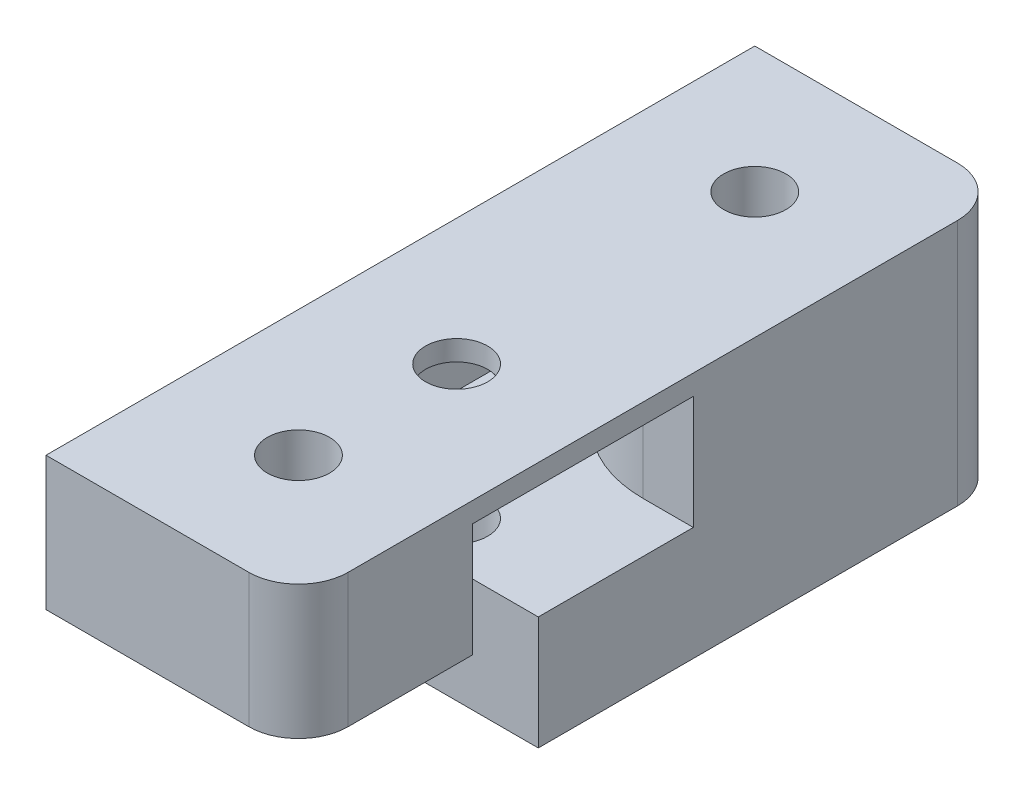
ISO-10303-21;
HEADER;
FILE_DESCRIPTION(('STEP AP214'),'2;1');
FILE_NAME('part.step','',(''),(''),'','','');
FILE_SCHEMA(('AUTOMOTIVE_DESIGN { 1 0 10303 214 1 1 1 1 }'));
ENDSEC;
DATA;
#1=APPLICATION_CONTEXT('core data for automotive mechanical design processes');
#2=APPLICATION_PROTOCOL_DEFINITION('international standard','automotive_design',2000,#1);
#3=PRODUCT_CONTEXT('',#1,'mechanical');
#4=PRODUCT('Part','Part','',(#3));
#5=PRODUCT_RELATED_PRODUCT_CATEGORY('part','',(#4));
#6=PRODUCT_DEFINITION_FORMATION('','',#4);
#7=PRODUCT_DEFINITION_CONTEXT('part definition',#1,'design');
#8=PRODUCT_DEFINITION('design','',#6,#7);
#9=PRODUCT_DEFINITION_SHAPE('','',#8);
#10=(LENGTH_UNIT() NAMED_UNIT(*) SI_UNIT(.MILLI.,.METRE.));
#11=(NAMED_UNIT(*) PLANE_ANGLE_UNIT() SI_UNIT($,.RADIAN.));
#12=(NAMED_UNIT(*) SI_UNIT($,.STERADIAN.) SOLID_ANGLE_UNIT());
#13=UNCERTAINTY_MEASURE_WITH_UNIT(LENGTH_MEASURE(1.E-05),#10,'distance_accuracy_value','');
#14=(GEOMETRIC_REPRESENTATION_CONTEXT(3) GLOBAL_UNCERTAINTY_ASSIGNED_CONTEXT((#13)) GLOBAL_UNIT_ASSIGNED_CONTEXT((#10,
#11,#12)) REPRESENTATION_CONTEXT('',''));
#15=CARTESIAN_POINT('',(0.,0.,0.));
#16=DIRECTION('',(0.,0.,1.));
#17=DIRECTION('',(1.,0.,0.));
#18=AXIS2_PLACEMENT_3D('',#15,#16,#17);
#19=CARTESIAN_POINT('',(-10.16,19.9,-46.89));
#20=DIRECTION('',(0.,0.,1.));
#21=DIRECTION('',(1.,0.,0.));
#22=AXIS2_PLACEMENT_3D('',#19,#20,#21);
#23=PLANE('',#22);
#24=DIRECTION('',(-1.,0.,0.));
#25=VECTOR('',#24,1.);
#26=CARTESIAN_POINT('',(-10.16,19.9,-46.89));
#27=LINE('',#26,#25);
#28=CARTESIAN_POINT('',(6.16,19.9,-46.89));
#29=VERTEX_POINT('',#28);
#30=CARTESIAN_POINT('',(-10.16,19.9,-46.89));
#31=VERTEX_POINT('',#30);
#32=EDGE_CURVE('E287',#29,#31,#27,.T.);
#33=ORIENTED_EDGE('',*,*,#32,.F.);
#34=DIRECTION('',(0.,-1.,0.));
#35=VECTOR('',#34,1.);
#36=CARTESIAN_POINT('',(6.16,19.9,-46.89));
#37=LINE('',#36,#35);
#38=CARTESIAN_POINT('',(6.16,0.,-46.89));
#39=VERTEX_POINT('',#38);
#40=EDGE_CURVE('E305',#29,#39,#37,.T.);
#41=ORIENTED_EDGE('',*,*,#40,.T.);
#42=DIRECTION('',(-1.,0.,0.));
#43=VECTOR('',#42,1.);
#44=CARTESIAN_POINT('',(-10.16,0.,-46.89));
#45=LINE('',#44,#43);
#46=CARTESIAN_POINT('',(-10.16,0.,-46.89));
#47=VERTEX_POINT('',#46);
#48=EDGE_CURVE('E297',#39,#47,#45,.T.);
#49=ORIENTED_EDGE('',*,*,#48,.T.);
#50=DIRECTION('',(0.,-1.,0.));
#51=VECTOR('',#50,1.);
#52=CARTESIAN_POINT('',(-10.16,19.9,-46.89));
#53=LINE('',#52,#51);
#54=EDGE_CURVE('E302',#31,#47,#53,.T.);
#55=ORIENTED_EDGE('',*,*,#54,.F.);
#56=EDGE_LOOP('',(#33,#41,#49,#55));
#57=FACE_BOUND('',#56,.T.);
#58=DIRECTION('',(1.,0.,0.));
#59=VECTOR('',#58,1.);
#60=CARTESIAN_POINT('',(-1.016,18.272,-46.89));
#61=LINE('',#60,#59);
#62=CARTESIAN_POINT('',(-8.89000000000001,18.272,-46.89));
#63=VERTEX_POINT('',#62);
#64=CARTESIAN_POINT('',(-3.89,18.272,-46.89));
#65=VERTEX_POINT('',#64);
#66=EDGE_CURVE('E188',#63,#65,#61,.T.);
#67=ORIENTED_EDGE('',*,*,#66,.F.);
#68=DIRECTION('',(0.,-1.,0.));
#69=VECTOR('',#68,1.);
#70=CARTESIAN_POINT('',(-8.89000000000001,18.272,-46.89));
#71=LINE('',#70,#69);
#72=CARTESIAN_POINT('',(-8.89000000000001,9.136,-46.89));
#73=VERTEX_POINT('',#72);
#74=EDGE_CURVE('E238',#63,#73,#71,.T.);
#75=ORIENTED_EDGE('',*,*,#74,.T.);
#76=DIRECTION('',(1.,0.,0.));
#77=VECTOR('',#76,1.);
#78=CARTESIAN_POINT('',(-1.016,9.136,-46.89));
#79=LINE('',#78,#77);
#80=CARTESIAN_POINT('',(-3.89,9.136,-46.89));
#81=VERTEX_POINT('',#80);
#82=EDGE_CURVE('E209',#73,#81,#79,.T.);
#83=ORIENTED_EDGE('',*,*,#82,.T.);
#84=DIRECTION('',(0.,-1.,0.));
#85=VECTOR('',#84,1.);
#86=CARTESIAN_POINT('',(-3.89,18.272,-46.89));
#87=LINE('',#86,#85);
#88=EDGE_CURVE('E182',#65,#81,#87,.T.);
#89=ORIENTED_EDGE('',*,*,#88,.F.);
#90=EDGE_LOOP('',(#67,#75,#83,#89));
#91=FACE_BOUND('',#90,.T.);
#92=ADVANCED_FACE('F34',(#57,#91),#23,.F.);
#93=CARTESIAN_POINT('',(0.,0.,-12.73));
#94=DIRECTION('',(0.,1.,0.));
#95=DIRECTION('',(0.,0.,1.));
#96=AXIS2_PLACEMENT_3D('',#93,#94,#95);
#97=CYLINDRICAL_SURFACE('',#96,2.5);
#98=CARTESIAN_POINT('',(0.,19.9,-12.73));
#99=DIRECTION('',(0.,1.,0.));
#100=DIRECTION('',(0.,0.,1.));
#101=AXIS2_PLACEMENT_3D('',#98,#99,#100);
#102=CIRCLE('',#101,2.5);
#103=CARTESIAN_POINT('',(0.,19.9,-10.23));
#104=VERTEX_POINT('',#103);
#105=EDGE_CURVE('E250',#104,#104,#102,.T.);
#106=ORIENTED_EDGE('',*,*,#105,.T.);
#107=EDGE_LOOP('',(#106));
#108=FACE_BOUND('',#107,.T.);
#109=CARTESIAN_POINT('',(0.,18.272,-12.73));
#110=DIRECTION('',(0.,-1.,0.));
#111=DIRECTION('',(0.,0.,-1.));
#112=AXIS2_PLACEMENT_3D('',#109,#110,#111);
#113=CIRCLE('',#112,2.5);
#114=CARTESIAN_POINT('',(0.,18.272,-15.23));
#115=VERTEX_POINT('',#114);
#116=EDGE_CURVE('E245',#115,#115,#113,.F.);
#117=ORIENTED_EDGE('',*,*,#116,.F.);
#118=EDGE_LOOP('',(#117));
#119=FACE_BOUND('',#118,.T.);
#120=ADVANCED_FACE('F402',(#108,#119),#97,.F.);
#121=CARTESIAN_POINT('',(-10.16,19.9,10.16));
#122=DIRECTION('',(1.,0.,0.));
#123=DIRECTION('',(0.,0.,-1.));
#124=AXIS2_PLACEMENT_3D('',#121,#122,#123);
#125=PLANE('',#124);
#126=DIRECTION('',(0.,0.,1.));
#127=VECTOR('',#126,1.);
#128=CARTESIAN_POINT('',(-10.16,0.,10.16));
#129=LINE('',#128,#127);
#130=CARTESIAN_POINT('',(-10.16,0.,-6.04780952081));
#131=VERTEX_POINT('',#130);
#132=EDGE_CURVE('E288',#47,#131,#129,.T.);
#133=ORIENTED_EDGE('',*,*,#132,.T.);
#134=DIRECTION('',(0.,-1.,0.));
#135=VECTOR('',#134,1.);
#136=CARTESIAN_POINT('',(-10.16,19.9,-6.04780952081));
#137=LINE('',#136,#135);
#138=CARTESIAN_POINT('',(-10.16,9.136,-6.04780952081));
#139=VERTEX_POINT('',#138);
#140=EDGE_CURVE('E42',#131,#139,#137,.F.);
#141=ORIENTED_EDGE('',*,*,#140,.T.);
#142=DIRECTION('',(0.,0.,-1.));
#143=VECTOR('',#142,1.);
#144=CARTESIAN_POINT('',(-10.16,9.136,10.16));
#145=LINE('',#144,#143);
#146=CARTESIAN_POINT('',(-10.16,9.136,10.16));
#147=VERTEX_POINT('',#146);
#148=EDGE_CURVE('E48',#147,#139,#145,.T.);
#149=ORIENTED_EDGE('',*,*,#148,.F.);
#150=DIRECTION('',(0.,-1.,0.));
#151=VECTOR('',#150,1.);
#152=CARTESIAN_POINT('',(-10.16,19.9,10.16));
#153=LINE('',#152,#151);
#154=CARTESIAN_POINT('',(-10.16,19.9,10.16));
#155=VERTEX_POINT('',#154);
#156=EDGE_CURVE('E295',#155,#147,#153,.T.);
#157=ORIENTED_EDGE('',*,*,#156,.F.);
#158=DIRECTION('',(0.,0.,1.));
#159=VECTOR('',#158,1.);
#160=CARTESIAN_POINT('',(-10.16,19.9,10.16));
#161=LINE('',#160,#159);
#162=EDGE_CURVE('E290',#31,#155,#161,.T.);
#163=ORIENTED_EDGE('',*,*,#162,.F.);
#164=ORIENTED_EDGE('',*,*,#54,.T.);
#165=EDGE_LOOP('',(#133,#141,#149,#157,#163,#164));
#166=FACE_BOUND('',#165,.T.);
#167=ADVANCED_FACE('F335',(#166),#125,.F.);
#168=CARTESIAN_POINT('',(-10.16,19.9,10.16));
#169=DIRECTION('',(0.,0.,-1.));
#170=DIRECTION('',(-1.,0.,0.));
#171=AXIS2_PLACEMENT_3D('',#168,#169,#170);
#172=PLANE('',#171);
#173=DIRECTION('',(-1.,0.,0.));
#174=VECTOR('',#173,1.);
#175=CARTESIAN_POINT('',(10.16,9.136,10.16));
#176=LINE('',#175,#174);
#177=CARTESIAN_POINT('',(6.16,9.136,10.16));
#178=VERTEX_POINT('',#177);
#179=EDGE_CURVE('E260',#178,#147,#176,.T.);
#180=ORIENTED_EDGE('',*,*,#179,.F.);
#181=DIRECTION('',(0.,-1.,0.));
#182=VECTOR('',#181,1.);
#183=CARTESIAN_POINT('',(6.16,19.9,10.16));
#184=LINE('',#183,#182);
#185=CARTESIAN_POINT('',(6.16,19.9,10.16));
#186=VERTEX_POINT('',#185);
#187=EDGE_CURVE('E320',#178,#186,#184,.F.);
#188=ORIENTED_EDGE('',*,*,#187,.T.);
#189=DIRECTION('',(1.,0.,0.));
#190=VECTOR('',#189,1.);
#191=CARTESIAN_POINT('',(-10.16,19.9,10.16));
#192=LINE('',#191,#190);
#193=EDGE_CURVE('E292',#155,#186,#192,.T.);
#194=ORIENTED_EDGE('',*,*,#193,.F.);
#195=ORIENTED_EDGE('',*,*,#156,.T.);
#196=EDGE_LOOP('',(#180,#188,#194,#195));
#197=FACE_BOUND('',#196,.T.);
#198=ADVANCED_FACE('F369',(#197),#172,.F.);
#199=CARTESIAN_POINT('',(0.,19.9,0.));
#200=DIRECTION('',(0.,-1.,0.));
#201=DIRECTION('',(0.,0.,-1.));
#202=AXIS2_PLACEMENT_3D('',#199,#200,#201);
#203=CYLINDRICAL_SURFACE('',#202,2.5);
#204=CARTESIAN_POINT('',(0.,19.9,0.));
#205=DIRECTION('',(0.,1.,0.));
#206=DIRECTION('',(0.,0.,1.));
#207=AXIS2_PLACEMENT_3D('',#204,#205,#206);
#208=CIRCLE('',#207,2.5);
#209=CARTESIAN_POINT('',(0.,19.9,2.5));
#210=VERTEX_POINT('',#209);
#211=EDGE_CURVE('E278',#210,#210,#208,.T.);
#212=ORIENTED_EDGE('',*,*,#211,.T.);
#213=EDGE_LOOP('',(#212));
#214=FACE_BOUND('',#213,.T.);
#215=CARTESIAN_POINT('',(0.,9.136,0.));
#216=DIRECTION('',(0.,-1.,0.));
#217=DIRECTION('',(0.,0.,-1.));
#218=AXIS2_PLACEMENT_3D('',#215,#216,#217);
#219=CIRCLE('',#218,2.5);
#220=CARTESIAN_POINT('',(0.,9.136,-2.5));
#221=VERTEX_POINT('',#220);
#222=EDGE_CURVE('E269',#221,#221,#219,.T.);
#223=ORIENTED_EDGE('',*,*,#222,.T.);
#224=EDGE_LOOP('',(#223));
#225=FACE_BOUND('',#224,.T.);
#226=ADVANCED_FACE('F417',(#214,#225),#203,.F.);
#227=CARTESIAN_POINT('',(6.16,19.9,6.16));
#228=DIRECTION('',(0.,-1.,0.));
#229=DIRECTION('',(0.,0.,-1.));
#230=AXIS2_PLACEMENT_3D('',#227,#228,#229);
#231=CYLINDRICAL_SURFACE('',#230,4.);
#232=ORIENTED_EDGE('',*,*,#187,.F.);
#233=CARTESIAN_POINT('',(6.16,9.136,6.16));
#234=DIRECTION('',(0.,-1.,0.));
#235=DIRECTION('',(0.,0.,-1.));
#236=AXIS2_PLACEMENT_3D('',#233,#234,#235);
#237=CIRCLE('',#236,4.);
#238=CARTESIAN_POINT('',(10.16,9.136,6.16));
#239=VERTEX_POINT('',#238);
#240=EDGE_CURVE('E322',#178,#239,#237,.F.);
#241=ORIENTED_EDGE('',*,*,#240,.T.);
#242=DIRECTION('',(0.,-1.,0.));
#243=VECTOR('',#242,1.);
#244=CARTESIAN_POINT('',(10.16,19.9,6.16));
#245=LINE('',#244,#243);
#246=CARTESIAN_POINT('',(10.16,19.9,6.16));
#247=VERTEX_POINT('',#246);
#248=EDGE_CURVE('E311',#247,#239,#245,.T.);
#249=ORIENTED_EDGE('',*,*,#248,.F.);
#250=CARTESIAN_POINT('',(6.16,19.9,6.16));
#251=DIRECTION('',(0.,-1.,0.));
#252=DIRECTION('',(0.,0.,-1.));
#253=AXIS2_PLACEMENT_3D('',#250,#251,#252);
#254=CIRCLE('',#253,4.);
#255=EDGE_CURVE('E316',#186,#247,#254,.F.);
#256=ORIENTED_EDGE('',*,*,#255,.F.);
#257=EDGE_LOOP('',(#232,#241,#249,#256));
#258=FACE_BOUND('',#257,.T.);
#259=ADVANCED_FACE('F366',(#258),#231,.T.);
#260=CARTESIAN_POINT('',(0.,19.9,0.));
#261=DIRECTION('',(0.,-1.,0.));
#262=DIRECTION('',(0.,0.,-1.));
#263=AXIS2_PLACEMENT_3D('',#260,#261,#262);
#264=PLANE('',#263);
#265=ORIENTED_EDGE('',*,*,#105,.F.);
#266=EDGE_LOOP('',(#265));
#267=FACE_BOUND('',#266,.T.);
#268=DIRECTION('',(0.,0.,-1.));
#269=VECTOR('',#268,1.);
#270=CARTESIAN_POINT('',(10.16,19.9,10.16));
#271=LINE('',#270,#269);
#272=CARTESIAN_POINT('',(10.16,19.9,-42.89));
#273=VERTEX_POINT('',#272);
#274=EDGE_CURVE('E284',#247,#273,#271,.T.);
#275=ORIENTED_EDGE('',*,*,#274,.T.);
#276=CARTESIAN_POINT('',(6.16,19.9,-42.89));
#277=DIRECTION('',(0.,-1.,0.));
#278=DIRECTION('',(0.,0.,-1.));
#279=AXIS2_PLACEMENT_3D('',#276,#277,#278);
#280=CIRCLE('',#279,4.);
#281=EDGE_CURVE('E318',#273,#29,#280,.F.);
#282=ORIENTED_EDGE('',*,*,#281,.T.);
#283=ORIENTED_EDGE('',*,*,#32,.T.);
#284=ORIENTED_EDGE('',*,*,#162,.T.);
#285=ORIENTED_EDGE('',*,*,#193,.T.);
#286=ORIENTED_EDGE('',*,*,#255,.T.);
#287=EDGE_LOOP('',(#275,#282,#283,#284,#285,#286));
#288=FACE_BOUND('',#287,.T.);
#289=ORIENTED_EDGE('',*,*,#211,.F.);
#290=EDGE_LOOP('',(#289));
#291=FACE_BOUND('',#290,.T.);
#292=CARTESIAN_POINT('',(0.,19.9,-36.73));
#293=DIRECTION('',(0.,1.,0.));
#294=DIRECTION('',(0.,0.,1.));
#295=AXIS2_PLACEMENT_3D('',#292,#293,#294);
#296=CIRCLE('',#295,2.5);
#297=CARTESIAN_POINT('',(0.,19.9,-34.23));
#298=VERTEX_POINT('',#297);
#299=EDGE_CURVE('E275',#298,#298,#296,.T.);
#300=ORIENTED_EDGE('',*,*,#299,.F.);
#301=EDGE_LOOP('',(#300));
#302=FACE_BOUND('',#301,.T.);
#303=ADVANCED_FACE('F374',(#267,#288,#291,#302),#264,.F.);
#304=CARTESIAN_POINT('',(0.,0.,0.));
#305=DIRECTION('',(0.,-1.,0.));
#306=DIRECTION('',(0.,0.,-1.));
#307=AXIS2_PLACEMENT_3D('',#304,#305,#306);
#308=PLANE('',#307);
#309=CARTESIAN_POINT('',(0.,0.,-12.73));
#310=DIRECTION('',(0.,1.,0.));
#311=DIRECTION('',(0.,0.,1.));
#312=AXIS2_PLACEMENT_3D('',#309,#310,#311);
#313=CIRCLE('',#312,2.5);
#314=CARTESIAN_POINT('',(0.,0.,-10.23));
#315=VERTEX_POINT('',#314);
#316=EDGE_CURVE('E246',#315,#315,#313,.T.);
#317=ORIENTED_EDGE('',*,*,#316,.T.);
#318=EDGE_LOOP('',(#317));
#319=FACE_BOUND('',#318,.T.);
#320=CARTESIAN_POINT('',(-1.016,0.,0.));
#321=DIRECTION('',(0.,-1.,0.));
#322=DIRECTION('',(0.,0.,-1.));
#323=AXIS2_PLACEMENT_3D('',#320,#321,#322);
#324=CIRCLE('',#323,9.144);
#325=CARTESIAN_POINT('',(-8.35716088328076,0.,-5.45161378729166));
#326=VERTEX_POINT('',#325);
#327=CARTESIAN_POINT('',(-1.016,0.,-9.144));
#328=VERTEX_POINT('',#327);
#329=EDGE_CURVE('E249',#326,#328,#324,.T.);
#330=ORIENTED_EDGE('',*,*,#329,.F.);
#331=CARTESIAN_POINT('',(-9.16,0.,-6.04780952081));
#332=DIRECTION('',(0.,-1.,0.));
#333=DIRECTION('',(0.,0.,-1.));
#334=AXIS2_PLACEMENT_3D('',#331,#332,#333);
#335=CIRCLE('',#334,1.);
#336=EDGE_CURVE('E56',#326,#131,#335,.T.);
#337=ORIENTED_EDGE('',*,*,#336,.T.);
#338=ORIENTED_EDGE('',*,*,#132,.F.);
#339=ORIENTED_EDGE('',*,*,#48,.F.);
#340=CARTESIAN_POINT('',(6.16,0.,-42.89));
#341=DIRECTION('',(0.,-1.,0.));
#342=DIRECTION('',(0.,0.,-1.));
#343=AXIS2_PLACEMENT_3D('',#340,#341,#342);
#344=CIRCLE('',#343,4.);
#345=CARTESIAN_POINT('',(10.16,0.,-42.89));
#346=VERTEX_POINT('',#345);
#347=EDGE_CURVE('E308',#39,#346,#344,.T.);
#348=ORIENTED_EDGE('',*,*,#347,.T.);
#349=DIRECTION('',(0.,0.,-1.));
#350=VECTOR('',#349,1.);
#351=CARTESIAN_POINT('',(10.16,0.,10.16));
#352=LINE('',#351,#350);
#353=CARTESIAN_POINT('',(10.16,0.,-9.144));
#354=VERTEX_POINT('',#353);
#355=EDGE_CURVE('E283',#354,#346,#352,.T.);
#356=ORIENTED_EDGE('',*,*,#355,.F.);
#357=DIRECTION('',(1.,0.,0.));
#358=VECTOR('',#357,1.);
#359=CARTESIAN_POINT('',(-1.016,0.,-9.144));
#360=LINE('',#359,#358);
#361=EDGE_CURVE('E256',#328,#354,#360,.T.);
#362=ORIENTED_EDGE('',*,*,#361,.F.);
#363=EDGE_LOOP('',(#330,#337,#338,#339,#348,#356,#362));
#364=FACE_BOUND('',#363,.T.);
#365=CARTESIAN_POINT('',(0.,0.,-36.73));
#366=DIRECTION('',(0.,1.,0.));
#367=DIRECTION('',(0.,0.,1.));
#368=AXIS2_PLACEMENT_3D('',#365,#366,#367);
#369=CIRCLE('',#368,2.5);
#370=CARTESIAN_POINT('',(0.,0.,-34.23));
#371=VERTEX_POINT('',#370);
#372=EDGE_CURVE('E274',#371,#371,#369,.T.);
#373=ORIENTED_EDGE('',*,*,#372,.T.);
#374=EDGE_LOOP('',(#373));
#375=FACE_BOUND('',#374,.T.);
#376=ADVANCED_FACE('F382',(#319,#364,#375),#308,.T.);
#377=CARTESIAN_POINT('',(10.16,19.9,10.16));
#378=DIRECTION('',(-1.,0.,0.));
#379=DIRECTION('',(0.,0.,1.));
#380=AXIS2_PLACEMENT_3D('',#377,#378,#379);
#381=PLANE('',#380);
#382=DIRECTION('',(0.,0.,1.));
#383=VECTOR('',#382,1.);
#384=CARTESIAN_POINT('',(10.16,9.136,-9.144));
#385=LINE('',#384,#383);
#386=CARTESIAN_POINT('',(10.16,9.136,-3.84));
#387=VERTEX_POINT('',#386);
#388=EDGE_CURVE('E258',#387,#239,#385,.T.);
#389=ORIENTED_EDGE('',*,*,#388,.F.);
#390=DIRECTION('',(0.,-1.,0.));
#391=VECTOR('',#390,1.);
#392=CARTESIAN_POINT('',(10.16,18.272,-3.84));
#393=LINE('',#392,#391);
#394=CARTESIAN_POINT('',(10.16,18.272,-3.84));
#395=VERTEX_POINT('',#394);
#396=EDGE_CURVE('E231',#395,#387,#393,.T.);
#397=ORIENTED_EDGE('',*,*,#396,.F.);
#398=DIRECTION('',(0.,0.,1.));
#399=VECTOR('',#398,1.);
#400=CARTESIAN_POINT('',(10.16,18.272,0.));
#401=LINE('',#400,#399);
#402=CARTESIAN_POINT('',(10.16,18.272,-21.62));
#403=VERTEX_POINT('',#402);
#404=EDGE_CURVE('E201',#403,#395,#401,.T.);
#405=ORIENTED_EDGE('',*,*,#404,.F.);
#406=DIRECTION('',(0.,-1.,0.));
#407=VECTOR('',#406,1.);
#408=CARTESIAN_POINT('',(10.16,18.272,-21.62));
#409=LINE('',#408,#407);
#410=CARTESIAN_POINT('',(10.16,9.136,-21.62));
#411=VERTEX_POINT('',#410);
#412=EDGE_CURVE('E228',#403,#411,#409,.T.);
#413=ORIENTED_EDGE('',*,*,#412,.T.);
#414=DIRECTION('',(0.,0.,1.));
#415=VECTOR('',#414,1.);
#416=CARTESIAN_POINT('',(10.16,9.136,0.));
#417=LINE('',#416,#415);
#418=CARTESIAN_POINT('',(10.16,9.136,-9.144));
#419=VERTEX_POINT('',#418);
#420=EDGE_CURVE('E222',#411,#419,#417,.T.);
#421=ORIENTED_EDGE('',*,*,#420,.T.);
#422=DIRECTION('',(0.,-1.,0.));
#423=VECTOR('',#422,1.);
#424=CARTESIAN_POINT('',(10.16,9.136,-9.144));
#425=LINE('',#424,#423);
#426=EDGE_CURVE('E266',#419,#354,#425,.T.);
#427=ORIENTED_EDGE('',*,*,#426,.T.);
#428=ORIENTED_EDGE('',*,*,#355,.T.);
#429=DIRECTION('',(0.,-1.,0.));
#430=VECTOR('',#429,1.);
#431=CARTESIAN_POINT('',(10.16,19.9,-42.89));
#432=LINE('',#431,#430);
#433=EDGE_CURVE('E314',#346,#273,#432,.F.);
#434=ORIENTED_EDGE('',*,*,#433,.T.);
#435=ORIENTED_EDGE('',*,*,#274,.F.);
#436=ORIENTED_EDGE('',*,*,#248,.T.);
#437=EDGE_LOOP('',(#389,#397,#405,#413,#421,#427,#428,#434,#435,#436));
#438=FACE_BOUND('',#437,.T.);
#439=ADVANCED_FACE('F359',(#438),#381,.F.);
#440=CARTESIAN_POINT('',(0.,19.9,-36.73));
#441=DIRECTION('',(0.,-1.,0.));
#442=DIRECTION('',(0.,0.,-1.));
#443=AXIS2_PLACEMENT_3D('',#440,#441,#442);
#444=CYLINDRICAL_SURFACE('',#443,2.5);
#445=ORIENTED_EDGE('',*,*,#299,.T.);
#446=EDGE_LOOP('',(#445));
#447=FACE_BOUND('',#446,.T.);
#448=ORIENTED_EDGE('',*,*,#372,.F.);
#449=EDGE_LOOP('',(#448));
#450=FACE_BOUND('',#449,.T.);
#451=ADVANCED_FACE('F414',(#447,#450),#444,.F.);
#452=CARTESIAN_POINT('',(6.16,19.9,-42.89));
#453=DIRECTION('',(0.,-1.,0.));
#454=DIRECTION('',(0.,0.,-1.));
#455=AXIS2_PLACEMENT_3D('',#452,#453,#454);
#456=CYLINDRICAL_SURFACE('',#455,4.);
#457=ORIENTED_EDGE('',*,*,#281,.F.);
#458=ORIENTED_EDGE('',*,*,#433,.F.);
#459=ORIENTED_EDGE('',*,*,#347,.F.);
#460=ORIENTED_EDGE('',*,*,#40,.F.);
#461=EDGE_LOOP('',(#457,#458,#459,#460));
#462=FACE_BOUND('',#461,.T.);
#463=ADVANCED_FACE('F388',(#462),#456,.T.);
#464=CARTESIAN_POINT('',(-1.016,9.136,0.));
#465=DIRECTION('',(0.,-1.,0.));
#466=DIRECTION('',(0.,0.,-1.));
#467=AXIS2_PLACEMENT_3D('',#464,#465,#466);
#468=CYLINDRICAL_SURFACE('',#467,9.144);
#469=CARTESIAN_POINT('',(-1.016,9.136,0.));
#470=DIRECTION('',(0.,-1.,0.));
#471=DIRECTION('',(0.,0.,-1.));
#472=AXIS2_PLACEMENT_3D('',#469,#470,#471);
#473=CIRCLE('',#472,9.144);
#474=CARTESIAN_POINT('',(-8.35716088328076,9.136,-5.45161378729166));
#475=VERTEX_POINT('',#474);
#476=CARTESIAN_POINT('',(-6.83900524784953,9.136,-7.0502018328213));
#477=VERTEX_POINT('',#476);
#478=EDGE_CURVE('E253',#475,#477,#473,.T.);
#479=ORIENTED_EDGE('',*,*,#478,.F.);
#480=DIRECTION('',(0.,-1.,0.));
#481=VECTOR('',#480,1.);
#482=CARTESIAN_POINT('',(-8.35716088328076,9.136,-5.45161378729166));
#483=LINE('',#482,#481);
#484=EDGE_CURVE('E325',#475,#326,#483,.T.);
#485=ORIENTED_EDGE('',*,*,#484,.T.);
#486=ORIENTED_EDGE('',*,*,#329,.T.);
#487=DIRECTION('',(0.,-1.,0.));
#488=VECTOR('',#487,1.);
#489=CARTESIAN_POINT('',(-1.016,9.136,-9.144));
#490=LINE('',#489,#488);
#491=CARTESIAN_POINT('',(-1.016,9.136,-9.144));
#492=VERTEX_POINT('',#491);
#493=EDGE_CURVE('E263',#492,#328,#490,.T.);
#494=ORIENTED_EDGE('',*,*,#493,.F.);
#495=CARTESIAN_POINT('',(-1.016,9.136,0.));
#496=DIRECTION('',(0.,-1.,0.));
#497=DIRECTION('',(0.,0.,-1.));
#498=AXIS2_PLACEMENT_3D('',#495,#496,#497);
#499=CIRCLE('',#498,9.144);
#500=EDGE_CURVE('E242',#492,#477,#499,.F.);
#501=ORIENTED_EDGE('',*,*,#500,.T.);
#502=EDGE_LOOP('',(#479,#485,#486,#494,#501));
#503=FACE_BOUND('',#502,.T.);
#504=ADVANCED_FACE('F345',(#503),#468,.F.);
#505=CARTESIAN_POINT('',(-1.016,9.136,-9.144));
#506=DIRECTION('',(0.,0.,-1.));
#507=DIRECTION('',(-1.,0.,0.));
#508=AXIS2_PLACEMENT_3D('',#505,#506,#507);
#509=PLANE('',#508);
#510=ORIENTED_EDGE('',*,*,#361,.T.);
#511=ORIENTED_EDGE('',*,*,#426,.F.);
#512=DIRECTION('',(1.,0.,0.));
#513=VECTOR('',#512,1.);
#514=CARTESIAN_POINT('',(-1.016,9.136,-9.144));
#515=LINE('',#514,#513);
#516=EDGE_CURVE('E255',#492,#419,#515,.T.);
#517=ORIENTED_EDGE('',*,*,#516,.F.);
#518=ORIENTED_EDGE('',*,*,#493,.T.);
#519=EDGE_LOOP('',(#510,#511,#517,#518));
#520=FACE_BOUND('',#519,.T.);
#521=ADVANCED_FACE('F391',(#520),#509,.F.);
#522=CARTESIAN_POINT('',(-1.016,9.136,0.));
#523=DIRECTION('',(0.,-1.,0.));
#524=DIRECTION('',(0.,0.,-1.));
#525=AXIS2_PLACEMENT_3D('',#522,#523,#524);
#526=PLANE('',#525);
#527=CARTESIAN_POINT('',(0.,9.136,-12.73));
#528=DIRECTION('',(0.,-1.,0.));
#529=DIRECTION('',(0.,0.,-1.));
#530=AXIS2_PLACEMENT_3D('',#527,#528,#529);
#531=CIRCLE('',#530,8.89);
#532=CARTESIAN_POINT('',(0.,9.136,-3.84));
#533=VERTEX_POINT('',#532);
#534=EDGE_CURVE('E216',#533,#477,#531,.T.);
#535=ORIENTED_EDGE('',*,*,#534,.F.);
#536=DIRECTION('',(-1.,0.,0.));
#537=VECTOR('',#536,1.);
#538=CARTESIAN_POINT('',(-1.016,9.136,-3.84));
#539=LINE('',#538,#537);
#540=EDGE_CURVE('E219',#387,#533,#539,.T.);
#541=ORIENTED_EDGE('',*,*,#540,.F.);
#542=ORIENTED_EDGE('',*,*,#388,.T.);
#543=ORIENTED_EDGE('',*,*,#240,.F.);
#544=ORIENTED_EDGE('',*,*,#179,.T.);
#545=ORIENTED_EDGE('',*,*,#148,.T.);
#546=CARTESIAN_POINT('',(-9.16,9.136,-6.04780952081));
#547=DIRECTION('',(0.,-1.,0.));
#548=DIRECTION('',(0.,0.,-1.));
#549=AXIS2_PLACEMENT_3D('',#546,#547,#548);
#550=CIRCLE('',#549,1.);
#551=EDGE_CURVE('E11',#139,#475,#550,.F.);
#552=ORIENTED_EDGE('',*,*,#551,.T.);
#553=ORIENTED_EDGE('',*,*,#478,.T.);
#554=EDGE_LOOP('',(#535,#541,#542,#543,#544,#545,#552,#553));
#555=FACE_BOUND('',#554,.T.);
#556=ORIENTED_EDGE('',*,*,#222,.F.);
#557=EDGE_LOOP('',(#556));
#558=FACE_BOUND('',#557,.T.);
#559=ADVANCED_FACE('F341',(#555,#558),#526,.T.);
#560=CARTESIAN_POINT('',(0.,9.136,-12.73));
#561=DIRECTION('',(0.,-1.,0.));
#562=DIRECTION('',(0.,0.,-1.));
#563=AXIS2_PLACEMENT_3D('',#560,#561,#562);
#564=CIRCLE('',#563,2.5);
#565=CARTESIAN_POINT('',(0.,9.136,-15.23));
#566=VERTEX_POINT('',#565);
#567=EDGE_CURVE('E181',#566,#566,#564,.F.);
#568=ORIENTED_EDGE('',*,*,#567,.T.);
#569=EDGE_LOOP('',(#568));
#570=FACE_BOUND('',#569,.T.);
#571=ORIENTED_EDGE('',*,*,#316,.F.);
#572=EDGE_LOOP('',(#571));
#573=FACE_BOUND('',#572,.T.);
#574=ADVANCED_FACE('F398',(#570,#573),#97,.F.);
#575=CARTESIAN_POINT('',(6.11,18.272,-31.62));
#576=DIRECTION('',(0.,-1.,0.));
#577=DIRECTION('',(0.,0.,-1.));
#578=AXIS2_PLACEMENT_3D('',#575,#576,#577);
#579=PLANE('',#578);
#580=CARTESIAN_POINT('',(6.11,18.272,-31.62));
#581=DIRECTION('',(0.,-1.,0.));
#582=DIRECTION('',(0.,0.,-1.));
#583=AXIS2_PLACEMENT_3D('',#580,#581,#582);
#584=CIRCLE('',#583,10.);
#585=CARTESIAN_POINT('',(6.11,18.272,-21.62));
#586=VERTEX_POINT('',#585);
#587=CARTESIAN_POINT('',(-3.89,18.272,-31.62));
#588=VERTEX_POINT('',#587);
#589=EDGE_CURVE('E161',#586,#588,#584,.T.);
#590=ORIENTED_EDGE('',*,*,#589,.F.);
#591=DIRECTION('',(1.,0.,0.));
#592=VECTOR('',#591,1.);
#593=CARTESIAN_POINT('',(-1.016,18.272,-21.62));
#594=LINE('',#593,#592);
#595=EDGE_CURVE('E204',#586,#403,#594,.T.);
#596=ORIENTED_EDGE('',*,*,#595,.T.);
#597=ORIENTED_EDGE('',*,*,#404,.T.);
#598=DIRECTION('',(-1.,0.,0.));
#599=VECTOR('',#598,1.);
#600=CARTESIAN_POINT('',(-1.016,18.272,-3.84));
#601=LINE('',#600,#599);
#602=CARTESIAN_POINT('',(0.,18.272,-3.84));
#603=VERTEX_POINT('',#602);
#604=EDGE_CURVE('E198',#395,#603,#601,.T.);
#605=ORIENTED_EDGE('',*,*,#604,.T.);
#606=CARTESIAN_POINT('',(0.,18.272,-12.73));
#607=DIRECTION('',(0.,-1.,0.));
#608=DIRECTION('',(0.,0.,-1.));
#609=AXIS2_PLACEMENT_3D('',#606,#607,#608);
#610=CIRCLE('',#609,8.89);
#611=CARTESIAN_POINT('',(-8.89,18.272,-12.73));
#612=VERTEX_POINT('',#611);
#613=EDGE_CURVE('E195',#603,#612,#610,.T.);
#614=ORIENTED_EDGE('',*,*,#613,.T.);
#615=DIRECTION('',(0.,0.,-1.));
#616=VECTOR('',#615,1.);
#617=CARTESIAN_POINT('',(-8.89,18.272,0.));
#618=LINE('',#617,#616);
#619=EDGE_CURVE('E191',#612,#63,#618,.T.);
#620=ORIENTED_EDGE('',*,*,#619,.T.);
#621=ORIENTED_EDGE('',*,*,#66,.T.);
#622=DIRECTION('',(0.,0.,1.));
#623=VECTOR('',#622,1.);
#624=CARTESIAN_POINT('',(-3.89,18.272,0.));
#625=LINE('',#624,#623);
#626=EDGE_CURVE('E172',#65,#588,#625,.T.);
#627=ORIENTED_EDGE('',*,*,#626,.T.);
#628=EDGE_LOOP('',(#590,#596,#597,#605,#614,#620,#621,#627));
#629=FACE_BOUND('',#628,.T.);
#630=ORIENTED_EDGE('',*,*,#116,.T.);
#631=EDGE_LOOP('',(#630));
#632=FACE_BOUND('',#631,.T.);
#633=ADVANCED_FACE('F184',(#629,#632),#579,.T.);
#634=CARTESIAN_POINT('',(6.11,9.136,-31.62));
#635=DIRECTION('',(0.,-1.,0.));
#636=DIRECTION('',(0.,0.,-1.));
#637=AXIS2_PLACEMENT_3D('',#634,#635,#636);
#638=PLANE('',#637);
#639=ORIENTED_EDGE('',*,*,#567,.F.);
#640=EDGE_LOOP('',(#639));
#641=FACE_BOUND('',#640,.T.);
#642=ORIENTED_EDGE('',*,*,#516,.T.);
#643=ORIENTED_EDGE('',*,*,#420,.F.);
#644=DIRECTION('',(1.,0.,0.));
#645=VECTOR('',#644,1.);
#646=CARTESIAN_POINT('',(-1.016,9.136,-21.62));
#647=LINE('',#646,#645);
#648=CARTESIAN_POINT('',(6.11,9.136,-21.62));
#649=VERTEX_POINT('',#648);
#650=EDGE_CURVE('E173',#649,#411,#647,.T.);
#651=ORIENTED_EDGE('',*,*,#650,.F.);
#652=CARTESIAN_POINT('',(6.11,9.136,-31.62));
#653=DIRECTION('',(0.,-1.,0.));
#654=DIRECTION('',(0.,0.,-1.));
#655=AXIS2_PLACEMENT_3D('',#652,#653,#654);
#656=CIRCLE('',#655,10.);
#657=CARTESIAN_POINT('',(-3.89,9.136,-31.62));
#658=VERTEX_POINT('',#657);
#659=EDGE_CURVE('E206',#649,#658,#656,.T.);
#660=ORIENTED_EDGE('',*,*,#659,.T.);
#661=DIRECTION('',(0.,0.,1.));
#662=VECTOR('',#661,1.);
#663=CARTESIAN_POINT('',(-3.89,9.136,0.));
#664=LINE('',#663,#662);
#665=EDGE_CURVE('E180',#81,#658,#664,.T.);
#666=ORIENTED_EDGE('',*,*,#665,.F.);
#667=ORIENTED_EDGE('',*,*,#82,.F.);
#668=DIRECTION('',(0.,0.,-1.));
#669=VECTOR('',#668,1.);
#670=CARTESIAN_POINT('',(-8.89,9.136,0.));
#671=LINE('',#670,#669);
#672=CARTESIAN_POINT('',(-8.89,9.136,-12.73));
#673=VERTEX_POINT('',#672);
#674=EDGE_CURVE('E212',#673,#73,#671,.T.);
#675=ORIENTED_EDGE('',*,*,#674,.F.);
#676=EDGE_CURVE('E215',#477,#673,#531,.T.);
#677=ORIENTED_EDGE('',*,*,#676,.F.);
#678=ORIENTED_EDGE('',*,*,#500,.F.);
#679=EDGE_LOOP('',(#642,#643,#651,#660,#666,#667,#675,#677,#678));
#680=FACE_BOUND('',#679,.T.);
#681=ADVANCED_FACE('F349',(#641,#680),#638,.F.);
#682=CARTESIAN_POINT('',(6.11,18.272,-31.62));
#683=DIRECTION('',(0.,-1.,0.));
#684=DIRECTION('',(0.,0.,-1.));
#685=AXIS2_PLACEMENT_3D('',#682,#683,#684);
#686=CYLINDRICAL_SURFACE('',#685,10.);
#687=ORIENTED_EDGE('',*,*,#659,.F.);
#688=DIRECTION('',(0.,-1.,0.));
#689=VECTOR('',#688,1.);
#690=CARTESIAN_POINT('',(6.11,18.272,-21.62));
#691=LINE('',#690,#689);
#692=EDGE_CURVE('E167',#586,#649,#691,.T.);
#693=ORIENTED_EDGE('',*,*,#692,.F.);
#694=ORIENTED_EDGE('',*,*,#589,.T.);
#695=DIRECTION('',(0.,-1.,0.));
#696=VECTOR('',#695,1.);
#697=CARTESIAN_POINT('',(-3.89,18.272,-31.62));
#698=LINE('',#697,#696);
#699=EDGE_CURVE('E165',#588,#658,#698,.T.);
#700=ORIENTED_EDGE('',*,*,#699,.T.);
#701=EDGE_LOOP('',(#687,#693,#694,#700));
#702=FACE_BOUND('',#701,.T.);
#703=ADVANCED_FACE('F164',(#702),#686,.T.);
#704=CARTESIAN_POINT('',(-3.89,18.272,0.));
#705=DIRECTION('',(1.,0.,0.));
#706=DIRECTION('',(0.,0.,-1.));
#707=AXIS2_PLACEMENT_3D('',#704,#705,#706);
#708=PLANE('',#707);
#709=ORIENTED_EDGE('',*,*,#665,.T.);
#710=ORIENTED_EDGE('',*,*,#699,.F.);
#711=ORIENTED_EDGE('',*,*,#626,.F.);
#712=ORIENTED_EDGE('',*,*,#88,.T.);
#713=EDGE_LOOP('',(#709,#710,#711,#712));
#714=FACE_BOUND('',#713,.T.);
#715=ADVANCED_FACE('F177',(#714),#708,.F.);
#716=CARTESIAN_POINT('',(-8.89,18.272,0.));
#717=DIRECTION('',(-1.,0.,0.));
#718=DIRECTION('',(0.,0.,1.));
#719=AXIS2_PLACEMENT_3D('',#716,#717,#718);
#720=PLANE('',#719);
#721=ORIENTED_EDGE('',*,*,#674,.T.);
#722=ORIENTED_EDGE('',*,*,#74,.F.);
#723=ORIENTED_EDGE('',*,*,#619,.F.);
#724=DIRECTION('',(0.,-1.,0.));
#725=VECTOR('',#724,1.);
#726=CARTESIAN_POINT('',(-8.89,18.272,-12.73));
#727=LINE('',#726,#725);
#728=EDGE_CURVE('E235',#612,#673,#727,.T.);
#729=ORIENTED_EDGE('',*,*,#728,.T.);
#730=EDGE_LOOP('',(#721,#722,#723,#729));
#731=FACE_BOUND('',#730,.T.);
#732=ADVANCED_FACE('F449',(#731),#720,.F.);
#733=CARTESIAN_POINT('',(0.,18.272,-12.73));
#734=DIRECTION('',(0.,-1.,0.));
#735=DIRECTION('',(0.,0.,-1.));
#736=AXIS2_PLACEMENT_3D('',#733,#734,#735);
#737=CYLINDRICAL_SURFACE('',#736,8.89);
#738=ORIENTED_EDGE('',*,*,#534,.T.);
#739=ORIENTED_EDGE('',*,*,#676,.T.);
#740=ORIENTED_EDGE('',*,*,#728,.F.);
#741=ORIENTED_EDGE('',*,*,#613,.F.);
#742=DIRECTION('',(0.,-1.,0.));
#743=VECTOR('',#742,1.);
#744=CARTESIAN_POINT('',(0.,18.272,-3.84));
#745=LINE('',#744,#743);
#746=EDGE_CURVE('E233',#603,#533,#745,.T.);
#747=ORIENTED_EDGE('',*,*,#746,.T.);
#748=EDGE_LOOP('',(#738,#739,#740,#741,#747));
#749=FACE_BOUND('',#748,.T.);
#750=ADVANCED_FACE('F352',(#749),#737,.F.);
#751=CARTESIAN_POINT('',(-1.016,18.272,-3.84));
#752=DIRECTION('',(0.,0.,1.));
#753=DIRECTION('',(1.,0.,0.));
#754=AXIS2_PLACEMENT_3D('',#751,#752,#753);
#755=PLANE('',#754);
#756=ORIENTED_EDGE('',*,*,#540,.T.);
#757=ORIENTED_EDGE('',*,*,#746,.F.);
#758=ORIENTED_EDGE('',*,*,#604,.F.);
#759=ORIENTED_EDGE('',*,*,#396,.T.);
#760=EDGE_LOOP('',(#756,#757,#758,#759));
#761=FACE_BOUND('',#760,.T.);
#762=ADVANCED_FACE('F455',(#761),#755,.F.);
#763=CARTESIAN_POINT('',(-1.016,18.272,-21.62));
#764=DIRECTION('',(0.,0.,-1.));
#765=DIRECTION('',(-1.,0.,0.));
#766=AXIS2_PLACEMENT_3D('',#763,#764,#765);
#767=PLANE('',#766);
#768=ORIENTED_EDGE('',*,*,#650,.T.);
#769=ORIENTED_EDGE('',*,*,#412,.F.);
#770=ORIENTED_EDGE('',*,*,#595,.F.);
#771=ORIENTED_EDGE('',*,*,#692,.T.);
#772=EDGE_LOOP('',(#768,#769,#770,#771));
#773=FACE_BOUND('',#772,.T.);
#774=ADVANCED_FACE('F458',(#773),#767,.F.);
#775=CARTESIAN_POINT('',(-9.16,9.136,-6.04780952081));
#776=DIRECTION('',(0.,-1.,0.));
#777=DIRECTION('',(0.,0.,-1.));
#778=AXIS2_PLACEMENT_3D('',#775,#776,#777);
#779=CYLINDRICAL_SURFACE('',#778,1.);
#780=ORIENTED_EDGE('',*,*,#551,.F.);
#781=ORIENTED_EDGE('',*,*,#140,.F.);
#782=ORIENTED_EDGE('',*,*,#336,.F.);
#783=ORIENTED_EDGE('',*,*,#484,.F.);
#784=EDGE_LOOP('',(#780,#781,#782,#783));
#785=FACE_BOUND('',#784,.T.);
#786=ADVANCED_FACE('F36',(#785),#779,.T.);
#787=CLOSED_SHELL('',(#92,#120,#167,#198,#226,#259,#303,#376,#439,#451,#463,#504,#521,#559,#574,
#633,#681,#703,#715,#732,#750,#762,#774,#786));
#788=MANIFOLD_SOLID_BREP('B2',#787);
#789=ADVANCED_BREP_SHAPE_REPRESENTATION('',(#18,#788),#14);
#790=SHAPE_DEFINITION_REPRESENTATION(#9,#789);
ENDSEC;
END-ISO-10303-21;
